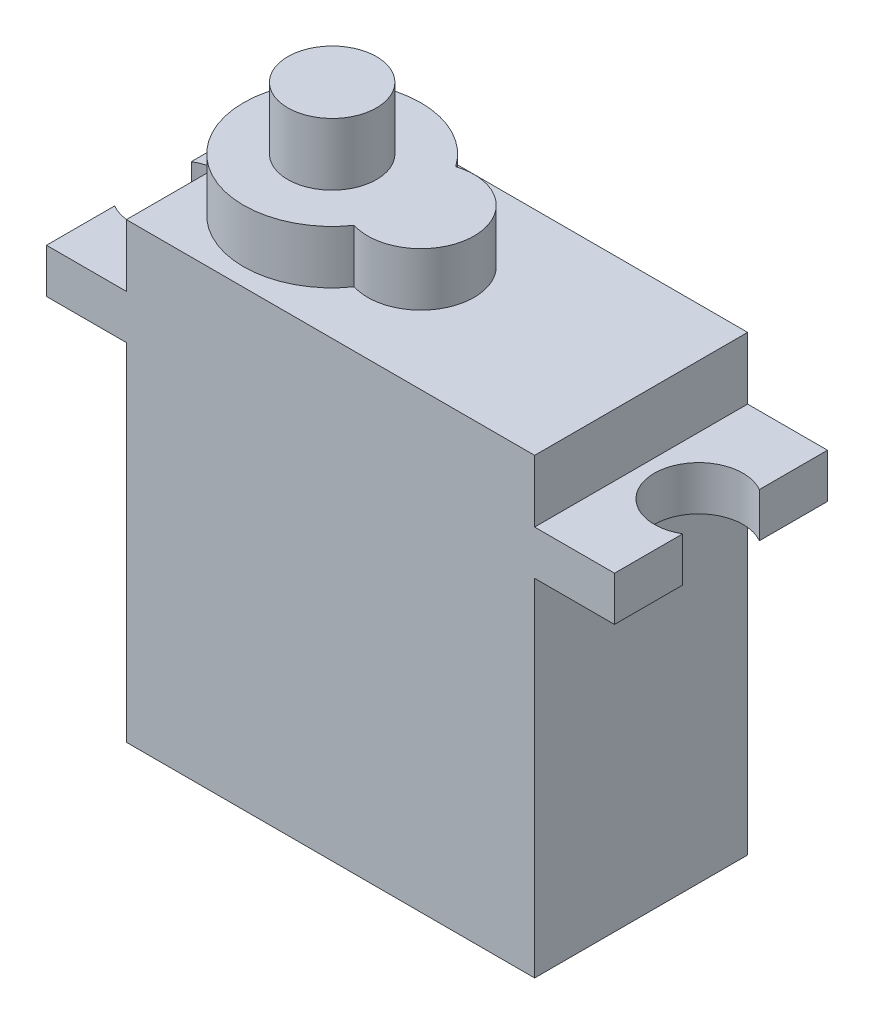
ISO-10303-21;
HEADER;
FILE_DESCRIPTION(('STEP AP214'),'2;1');
FILE_NAME('part.step','',(''),(''),'','','');
FILE_SCHEMA(('AUTOMOTIVE_DESIGN { 1 0 10303 214 1 1 1 1 }'));
ENDSEC;
DATA;
#1=APPLICATION_CONTEXT('core data for automotive mechanical design processes');
#2=APPLICATION_PROTOCOL_DEFINITION('international standard','automotive_design',2000,#1);
#3=PRODUCT_CONTEXT('',#1,'mechanical');
#4=PRODUCT('Part','Part','',(#3));
#5=PRODUCT_RELATED_PRODUCT_CATEGORY('part','',(#4));
#6=PRODUCT_DEFINITION_FORMATION('','',#4);
#7=PRODUCT_DEFINITION_CONTEXT('part definition',#1,'design');
#8=PRODUCT_DEFINITION('design','',#6,#7);
#9=PRODUCT_DEFINITION_SHAPE('','',#8);
#10=(LENGTH_UNIT() NAMED_UNIT(*) SI_UNIT(.MILLI.,.METRE.));
#11=(NAMED_UNIT(*) PLANE_ANGLE_UNIT() SI_UNIT($,.RADIAN.));
#12=(NAMED_UNIT(*) SI_UNIT($,.STERADIAN.) SOLID_ANGLE_UNIT());
#13=UNCERTAINTY_MEASURE_WITH_UNIT(LENGTH_MEASURE(1.E-05),#10,'distance_accuracy_value','');
#14=(GEOMETRIC_REPRESENTATION_CONTEXT(3) GLOBAL_UNCERTAINTY_ASSIGNED_CONTEXT((#13)) GLOBAL_UNIT_ASSIGNED_CONTEXT((#10,
#11,#12)) REPRESENTATION_CONTEXT('',''));
#15=CARTESIAN_POINT('',(0.,0.,0.));
#16=DIRECTION('',(0.,0.,1.));
#17=DIRECTION('',(1.,0.,0.));
#18=AXIS2_PLACEMENT_3D('',#15,#16,#17);
#19=CARTESIAN_POINT('',(16.,22.,6.));
#20=DIRECTION('',(-1.,0.,0.));
#21=DIRECTION('',(0.,0.,1.));
#22=AXIS2_PLACEMENT_3D('',#19,#20,#21);
#23=PLANE('',#22);
#24=DIRECTION('',(0.,0.,-1.));
#25=VECTOR('',#24,1.);
#26=CARTESIAN_POINT('',(16.,19.5,6.));
#27=LINE('',#26,#25);
#28=CARTESIAN_POINT('',(16.,19.5,6.));
#29=VERTEX_POINT('',#28);
#30=CARTESIAN_POINT('',(16.,19.5,2.16100835295899));
#31=VERTEX_POINT('',#30);
#32=EDGE_CURVE('E233',#29,#31,#27,.T.);
#33=ORIENTED_EDGE('',*,*,#32,.T.);
#34=DIRECTION('',(0.,1.,0.));
#35=VECTOR('',#34,1.);
#36=CARTESIAN_POINT('',(16.,0.,2.161008352959));
#37=LINE('',#36,#35);
#38=CARTESIAN_POINT('',(16.,22.,2.16100835295899));
#39=VERTEX_POINT('',#38);
#40=EDGE_CURVE('E11',#31,#39,#37,.T.);
#41=ORIENTED_EDGE('',*,*,#40,.T.);
#42=DIRECTION('',(0.,0.,-1.));
#43=VECTOR('',#42,1.);
#44=CARTESIAN_POINT('',(16.,22.,6.));
#45=LINE('',#44,#43);
#46=CARTESIAN_POINT('',(16.,22.,6.));
#47=VERTEX_POINT('',#46);
#48=EDGE_CURVE('E218',#47,#39,#45,.T.);
#49=ORIENTED_EDGE('',*,*,#48,.F.);
#50=DIRECTION('',(0.,-1.,0.));
#51=VECTOR('',#50,1.);
#52=CARTESIAN_POINT('',(16.,22.,6.));
#53=LINE('',#52,#51);
#54=EDGE_CURVE('E232',#47,#29,#53,.T.);
#55=ORIENTED_EDGE('',*,*,#54,.T.);
#56=EDGE_LOOP('',(#33,#41,#49,#55));
#57=FACE_BOUND('',#56,.T.);
#58=ADVANCED_FACE('F33',(#57),#23,.F.);
#59=CARTESIAN_POINT('',(-16.,22.,6.));
#60=DIRECTION('',(1.,0.,0.));
#61=DIRECTION('',(0.,0.,-1.));
#62=AXIS2_PLACEMENT_3D('',#59,#60,#61);
#63=PLANE('',#62);
#64=DIRECTION('',(0.,0.,1.));
#65=VECTOR('',#64,1.);
#66=CARTESIAN_POINT('',(-16.,19.5,6.));
#67=LINE('',#66,#65);
#68=CARTESIAN_POINT('',(-16.,19.5,-6.));
#69=VERTEX_POINT('',#68);
#70=CARTESIAN_POINT('',(-16.,19.5,-2.16100835295899));
#71=VERTEX_POINT('',#70);
#72=EDGE_CURVE('E241',#69,#71,#67,.T.);
#73=ORIENTED_EDGE('',*,*,#72,.T.);
#74=DIRECTION('',(0.,1.,0.));
#75=VECTOR('',#74,1.);
#76=CARTESIAN_POINT('',(-16.,0.,-2.16100835295899));
#77=LINE('',#76,#75);
#78=CARTESIAN_POINT('',(-16.,22.,-2.16100835295899));
#79=VERTEX_POINT('',#78);
#80=EDGE_CURVE('E174',#71,#79,#77,.T.);
#81=ORIENTED_EDGE('',*,*,#80,.T.);
#82=DIRECTION('',(0.,0.,1.));
#83=VECTOR('',#82,1.);
#84=CARTESIAN_POINT('',(-16.,22.,6.));
#85=LINE('',#84,#83);
#86=CARTESIAN_POINT('',(-16.,22.,-6.));
#87=VERTEX_POINT('',#86);
#88=EDGE_CURVE('E226',#87,#79,#85,.T.);
#89=ORIENTED_EDGE('',*,*,#88,.F.);
#90=DIRECTION('',(0.,-1.,0.));
#91=VECTOR('',#90,1.);
#92=CARTESIAN_POINT('',(-16.,22.,-6.));
#93=LINE('',#92,#91);
#94=EDGE_CURVE('E253',#87,#69,#93,.T.);
#95=ORIENTED_EDGE('',*,*,#94,.T.);
#96=EDGE_LOOP('',(#73,#81,#89,#95));
#97=FACE_BOUND('',#96,.T.);
#98=ADVANCED_FACE('F330',(#97),#63,.F.);
#99=CARTESIAN_POINT('',(0.,22.,0.));
#100=DIRECTION('',(0.,-1.,0.));
#101=DIRECTION('',(0.,0.,-1.));
#102=AXIS2_PLACEMENT_3D('',#99,#100,#101);
#103=PLANE('',#102);
#104=ORIENTED_EDGE('',*,*,#48,.T.);
#105=CARTESIAN_POINT('',(14.7430024270344,22.,0.));
#106=DIRECTION('',(0.,-1.,0.));
#107=DIRECTION('',(0.,0.,-1.));
#108=AXIS2_PLACEMENT_3D('',#105,#106,#107);
#109=CIRCLE('',#108,2.5);
#110=CARTESIAN_POINT('',(16.,22.,-2.16100835295899));
#111=VERTEX_POINT('',#110);
#112=EDGE_CURVE('E187',#39,#111,#109,.T.);
#113=ORIENTED_EDGE('',*,*,#112,.T.);
#114=CARTESIAN_POINT('',(16.,22.,-6.));
#115=VERTEX_POINT('',#114);
#116=EDGE_CURVE('E222',#111,#115,#45,.T.);
#117=ORIENTED_EDGE('',*,*,#116,.T.);
#118=DIRECTION('',(-1.,0.,0.));
#119=VECTOR('',#118,1.);
#120=CARTESIAN_POINT('',(-16.,22.,-6.));
#121=LINE('',#120,#119);
#122=CARTESIAN_POINT('',(11.5,22.,-6.));
#123=VERTEX_POINT('',#122);
#124=EDGE_CURVE('E223',#115,#123,#121,.T.);
#125=ORIENTED_EDGE('',*,*,#124,.T.);
#126=DIRECTION('',(0.,0.,-1.));
#127=VECTOR('',#126,1.);
#128=CARTESIAN_POINT('',(11.5,22.,6.));
#129=LINE('',#128,#127);
#130=CARTESIAN_POINT('',(11.5,22.,6.));
#131=VERTEX_POINT('',#130);
#132=EDGE_CURVE('E195',#131,#123,#129,.T.);
#133=ORIENTED_EDGE('',*,*,#132,.F.);
#134=DIRECTION('',(1.,0.,0.));
#135=VECTOR('',#134,1.);
#136=CARTESIAN_POINT('',(-16.,22.,6.));
#137=LINE('',#136,#135);
#138=EDGE_CURVE('E229',#131,#47,#137,.T.);
#139=ORIENTED_EDGE('',*,*,#138,.T.);
#140=EDGE_LOOP('',(#104,#113,#117,#125,#133,#139));
#141=FACE_BOUND('',#140,.T.);
#142=ADVANCED_FACE('F304',(#141),#103,.F.);
#143=ORIENTED_EDGE('',*,*,#88,.T.);
#144=CARTESIAN_POINT('',(-14.7430024270344,22.,0.));
#145=DIRECTION('',(0.,-1.,0.));
#146=DIRECTION('',(0.,0.,-1.));
#147=AXIS2_PLACEMENT_3D('',#144,#145,#146);
#148=CIRCLE('',#147,2.5);
#149=CARTESIAN_POINT('',(-16.,22.,2.16100835295899));
#150=VERTEX_POINT('',#149);
#151=EDGE_CURVE('E182',#79,#150,#148,.T.);
#152=ORIENTED_EDGE('',*,*,#151,.T.);
#153=CARTESIAN_POINT('',(-16.,22.,6.));
#154=VERTEX_POINT('',#153);
#155=EDGE_CURVE('E225',#150,#154,#85,.T.);
#156=ORIENTED_EDGE('',*,*,#155,.T.);
#157=CARTESIAN_POINT('',(-11.5,22.,6.));
#158=VERTEX_POINT('',#157);
#159=EDGE_CURVE('E230',#154,#158,#137,.T.);
#160=ORIENTED_EDGE('',*,*,#159,.T.);
#161=DIRECTION('',(0.,0.,1.));
#162=VECTOR('',#161,1.);
#163=CARTESIAN_POINT('',(-11.5,22.,-6.));
#164=LINE('',#163,#162);
#165=CARTESIAN_POINT('',(-11.5,22.,-6.));
#166=VERTEX_POINT('',#165);
#167=EDGE_CURVE('E190',#166,#158,#164,.T.);
#168=ORIENTED_EDGE('',*,*,#167,.F.);
#169=EDGE_CURVE('E221',#166,#87,#121,.T.);
#170=ORIENTED_EDGE('',*,*,#169,.T.);
#171=EDGE_LOOP('',(#143,#152,#156,#160,#168,#170));
#172=FACE_BOUND('',#171,.T.);
#173=ADVANCED_FACE('F378',(#172),#103,.F.);
#174=CARTESIAN_POINT('',(11.5,19.5,6.));
#175=DIRECTION('',(-1.,0.,0.));
#176=DIRECTION('',(0.,0.,1.));
#177=AXIS2_PLACEMENT_3D('',#174,#175,#176);
#178=PLANE('',#177);
#179=DIRECTION('',(0.,0.,-1.));
#180=VECTOR('',#179,1.);
#181=CARTESIAN_POINT('',(11.5,0.,6.));
#182=LINE('',#181,#180);
#183=CARTESIAN_POINT('',(11.5,0.,6.));
#184=VERTEX_POINT('',#183);
#185=CARTESIAN_POINT('',(11.5,0.,-6.));
#186=VERTEX_POINT('',#185);
#187=EDGE_CURVE('E259',#184,#186,#182,.T.);
#188=ORIENTED_EDGE('',*,*,#187,.T.);
#189=DIRECTION('',(0.,-1.,0.));
#190=VECTOR('',#189,1.);
#191=CARTESIAN_POINT('',(11.5,19.5,-6.));
#192=LINE('',#191,#190);
#193=CARTESIAN_POINT('',(11.5,19.5,-6.));
#194=VERTEX_POINT('',#193);
#195=EDGE_CURVE('E283',#194,#186,#192,.T.);
#196=ORIENTED_EDGE('',*,*,#195,.F.);
#197=DIRECTION('',(0.,0.,-1.));
#198=VECTOR('',#197,1.);
#199=CARTESIAN_POINT('',(11.5,19.5,6.));
#200=LINE('',#199,#198);
#201=CARTESIAN_POINT('',(11.5,19.5,6.));
#202=VERTEX_POINT('',#201);
#203=EDGE_CURVE('E260',#202,#194,#200,.T.);
#204=ORIENTED_EDGE('',*,*,#203,.F.);
#205=DIRECTION('',(0.,-1.,0.));
#206=VECTOR('',#205,1.);
#207=CARTESIAN_POINT('',(11.5,19.5,6.));
#208=LINE('',#207,#206);
#209=EDGE_CURVE('E267',#202,#184,#208,.T.);
#210=ORIENTED_EDGE('',*,*,#209,.T.);
#211=EDGE_LOOP('',(#188,#196,#204,#210));
#212=FACE_BOUND('',#211,.T.);
#213=ADVANCED_FACE('F35',(#212),#178,.F.);
#214=CARTESIAN_POINT('',(-11.5,19.5,-6.));
#215=DIRECTION('',(0.,0.,1.));
#216=DIRECTION('',(1.,0.,0.));
#217=AXIS2_PLACEMENT_3D('',#214,#215,#216);
#218=PLANE('',#217);
#219=DIRECTION('',(-1.,0.,0.));
#220=VECTOR('',#219,1.);
#221=CARTESIAN_POINT('',(-11.5,0.,-6.));
#222=LINE('',#221,#220);
#223=CARTESIAN_POINT('',(-11.5,0.,-6.));
#224=VERTEX_POINT('',#223);
#225=EDGE_CURVE('E270',#186,#224,#222,.T.);
#226=ORIENTED_EDGE('',*,*,#225,.T.);
#227=DIRECTION('',(0.,-1.,0.));
#228=VECTOR('',#227,1.);
#229=CARTESIAN_POINT('',(-11.5,19.5,-6.));
#230=LINE('',#229,#228);
#231=CARTESIAN_POINT('',(-11.5,19.5,-6.));
#232=VERTEX_POINT('',#231);
#233=EDGE_CURVE('E280',#232,#224,#230,.T.);
#234=ORIENTED_EDGE('',*,*,#233,.F.);
#235=DIRECTION('',(-1.,0.,0.));
#236=VECTOR('',#235,1.);
#237=CARTESIAN_POINT('',(-16.,19.5,-6.));
#238=LINE('',#237,#236);
#239=EDGE_CURVE('E236',#232,#69,#238,.T.);
#240=ORIENTED_EDGE('',*,*,#239,.T.);
#241=ORIENTED_EDGE('',*,*,#94,.F.);
#242=ORIENTED_EDGE('',*,*,#169,.F.);
#243=DIRECTION('',(0.,-1.,0.));
#244=VECTOR('',#243,1.);
#245=CARTESIAN_POINT('',(-11.5,25.5,-6.));
#246=LINE('',#245,#244);
#247=CARTESIAN_POINT('',(-11.5,25.5,-6.));
#248=VERTEX_POINT('',#247);
#249=EDGE_CURVE('E214',#248,#166,#246,.T.);
#250=ORIENTED_EDGE('',*,*,#249,.F.);
#251=DIRECTION('',(-1.,0.,0.));
#252=VECTOR('',#251,1.);
#253=CARTESIAN_POINT('',(11.5,25.5,-6.));
#254=LINE('',#253,#252);
#255=CARTESIAN_POINT('',(11.5,25.5,-6.));
#256=VERTEX_POINT('',#255);
#257=EDGE_CURVE('E191',#256,#248,#254,.T.);
#258=ORIENTED_EDGE('',*,*,#257,.F.);
#259=DIRECTION('',(0.,-1.,0.));
#260=VECTOR('',#259,1.);
#261=CARTESIAN_POINT('',(11.5,25.5,-6.));
#262=LINE('',#261,#260);
#263=EDGE_CURVE('E201',#256,#123,#262,.T.);
#264=ORIENTED_EDGE('',*,*,#263,.T.);
#265=ORIENTED_EDGE('',*,*,#124,.F.);
#266=DIRECTION('',(0.,-1.,0.));
#267=VECTOR('',#266,1.);
#268=CARTESIAN_POINT('',(16.,22.,-6.));
#269=LINE('',#268,#267);
#270=CARTESIAN_POINT('',(16.,19.5,-6.));
#271=VERTEX_POINT('',#270);
#272=EDGE_CURVE('E256',#115,#271,#269,.T.);
#273=ORIENTED_EDGE('',*,*,#272,.T.);
#274=EDGE_CURVE('E237',#271,#194,#238,.T.);
#275=ORIENTED_EDGE('',*,*,#274,.T.);
#276=ORIENTED_EDGE('',*,*,#195,.T.);
#277=EDGE_LOOP('',(#226,#234,#240,#241,#242,#250,#258,#264,#265,#273,#275,#276));
#278=FACE_BOUND('',#277,.T.);
#279=ADVANCED_FACE('F300',(#278),#218,.F.);
#280=CARTESIAN_POINT('',(-11.5,19.5,6.));
#281=DIRECTION('',(1.,0.,0.));
#282=DIRECTION('',(0.,0.,-1.));
#283=AXIS2_PLACEMENT_3D('',#280,#281,#282);
#284=PLANE('',#283);
#285=DIRECTION('',(0.,0.,1.));
#286=VECTOR('',#285,1.);
#287=CARTESIAN_POINT('',(-11.5,0.,6.));
#288=LINE('',#287,#286);
#289=CARTESIAN_POINT('',(-11.5,0.,6.));
#290=VERTEX_POINT('',#289);
#291=EDGE_CURVE('E272',#224,#290,#288,.T.);
#292=ORIENTED_EDGE('',*,*,#291,.T.);
#293=DIRECTION('',(0.,-1.,0.));
#294=VECTOR('',#293,1.);
#295=CARTESIAN_POINT('',(-11.5,19.5,6.));
#296=LINE('',#295,#294);
#297=CARTESIAN_POINT('',(-11.5,19.5,6.));
#298=VERTEX_POINT('',#297);
#299=EDGE_CURVE('E277',#298,#290,#296,.T.);
#300=ORIENTED_EDGE('',*,*,#299,.F.);
#301=DIRECTION('',(0.,0.,1.));
#302=VECTOR('',#301,1.);
#303=CARTESIAN_POINT('',(-11.5,19.5,6.));
#304=LINE('',#303,#302);
#305=EDGE_CURVE('E263',#232,#298,#304,.T.);
#306=ORIENTED_EDGE('',*,*,#305,.F.);
#307=ORIENTED_EDGE('',*,*,#233,.T.);
#308=EDGE_LOOP('',(#292,#300,#306,#307));
#309=FACE_BOUND('',#308,.T.);
#310=ADVANCED_FACE('F397',(#309),#284,.F.);
#311=CARTESIAN_POINT('',(-11.5,19.5,6.));
#312=DIRECTION('',(0.,0.,-1.));
#313=DIRECTION('',(-1.,0.,0.));
#314=AXIS2_PLACEMENT_3D('',#311,#312,#313);
#315=PLANE('',#314);
#316=DIRECTION('',(1.,0.,0.));
#317=VECTOR('',#316,1.);
#318=CARTESIAN_POINT('',(-11.5,0.,6.));
#319=LINE('',#318,#317);
#320=EDGE_CURVE('E264',#290,#184,#319,.T.);
#321=ORIENTED_EDGE('',*,*,#320,.T.);
#322=ORIENTED_EDGE('',*,*,#209,.F.);
#323=DIRECTION('',(1.,0.,0.));
#324=VECTOR('',#323,1.);
#325=CARTESIAN_POINT('',(-16.,19.5,6.));
#326=LINE('',#325,#324);
#327=EDGE_CURVE('E244',#202,#29,#326,.T.);
#328=ORIENTED_EDGE('',*,*,#327,.T.);
#329=ORIENTED_EDGE('',*,*,#54,.F.);
#330=ORIENTED_EDGE('',*,*,#138,.F.);
#331=DIRECTION('',(0.,-1.,0.));
#332=VECTOR('',#331,1.);
#333=CARTESIAN_POINT('',(11.5,25.5,6.));
#334=LINE('',#333,#332);
#335=CARTESIAN_POINT('',(11.5,25.5,6.));
#336=VERTEX_POINT('',#335);
#337=EDGE_CURVE('E208',#336,#131,#334,.T.);
#338=ORIENTED_EDGE('',*,*,#337,.F.);
#339=DIRECTION('',(1.,0.,0.));
#340=VECTOR('',#339,1.);
#341=CARTESIAN_POINT('',(-11.5,25.5,6.));
#342=LINE('',#341,#340);
#343=CARTESIAN_POINT('',(-11.5,25.5,6.));
#344=VERTEX_POINT('',#343);
#345=EDGE_CURVE('E197',#344,#336,#342,.T.);
#346=ORIENTED_EDGE('',*,*,#345,.F.);
#347=DIRECTION('',(0.,-1.,0.));
#348=VECTOR('',#347,1.);
#349=CARTESIAN_POINT('',(-11.5,25.5,6.));
#350=LINE('',#349,#348);
#351=EDGE_CURVE('E211',#344,#158,#350,.T.);
#352=ORIENTED_EDGE('',*,*,#351,.T.);
#353=ORIENTED_EDGE('',*,*,#159,.F.);
#354=DIRECTION('',(0.,-1.,0.));
#355=VECTOR('',#354,1.);
#356=CARTESIAN_POINT('',(-16.,22.,6.));
#357=LINE('',#356,#355);
#358=CARTESIAN_POINT('',(-16.,19.5,6.));
#359=VERTEX_POINT('',#358);
#360=EDGE_CURVE('E250',#154,#359,#357,.T.);
#361=ORIENTED_EDGE('',*,*,#360,.T.);
#362=EDGE_CURVE('E245',#359,#298,#326,.T.);
#363=ORIENTED_EDGE('',*,*,#362,.T.);
#364=ORIENTED_EDGE('',*,*,#299,.T.);
#365=EDGE_LOOP('',(#321,#322,#328,#329,#330,#338,#346,#352,#353,#361,#363,#364));
#366=FACE_BOUND('',#365,.T.);
#367=ADVANCED_FACE('F312',(#366),#315,.F.);
#368=CARTESIAN_POINT('',(0.,0.,0.));
#369=DIRECTION('',(0.,-1.,0.));
#370=DIRECTION('',(0.,0.,-1.));
#371=AXIS2_PLACEMENT_3D('',#368,#369,#370);
#372=PLANE('',#371);
#373=ORIENTED_EDGE('',*,*,#187,.F.);
#374=ORIENTED_EDGE('',*,*,#320,.F.);
#375=ORIENTED_EDGE('',*,*,#291,.F.);
#376=ORIENTED_EDGE('',*,*,#225,.F.);
#377=EDGE_LOOP('',(#373,#374,#375,#376));
#378=FACE_BOUND('',#377,.T.);
#379=ADVANCED_FACE('F346',(#378),#372,.T.);
#380=CARTESIAN_POINT('',(0.,19.5,0.));
#381=DIRECTION('',(0.,-1.,0.));
#382=DIRECTION('',(0.,0.,-1.));
#383=AXIS2_PLACEMENT_3D('',#380,#381,#382);
#384=PLANE('',#383);
#385=CARTESIAN_POINT('',(14.7430024270344,19.5,0.));
#386=DIRECTION('',(0.,-1.,0.));
#387=DIRECTION('',(0.,0.,-1.));
#388=AXIS2_PLACEMENT_3D('',#385,#386,#387);
#389=CIRCLE('',#388,2.5);
#390=CARTESIAN_POINT('',(16.,19.5,-2.161008352959));
#391=VERTEX_POINT('',#390);
#392=EDGE_CURVE('E55',#31,#391,#389,.T.);
#393=ORIENTED_EDGE('',*,*,#392,.F.);
#394=ORIENTED_EDGE('',*,*,#32,.F.);
#395=ORIENTED_EDGE('',*,*,#327,.F.);
#396=ORIENTED_EDGE('',*,*,#203,.T.);
#397=ORIENTED_EDGE('',*,*,#274,.F.);
#398=EDGE_CURVE('E217',#391,#271,#27,.T.);
#399=ORIENTED_EDGE('',*,*,#398,.F.);
#400=EDGE_LOOP('',(#393,#394,#395,#396,#397,#399));
#401=FACE_BOUND('',#400,.T.);
#402=ADVANCED_FACE('F294',(#401),#384,.T.);
#403=ORIENTED_EDGE('',*,*,#116,.F.);
#404=DIRECTION('',(0.,1.,0.));
#405=VECTOR('',#404,1.);
#406=CARTESIAN_POINT('',(16.,0.,-2.161008352959));
#407=LINE('',#406,#405);
#408=EDGE_CURVE('E41',#111,#391,#407,.F.);
#409=ORIENTED_EDGE('',*,*,#408,.T.);
#410=ORIENTED_EDGE('',*,*,#398,.T.);
#411=ORIENTED_EDGE('',*,*,#272,.F.);
#412=EDGE_LOOP('',(#403,#409,#410,#411));
#413=FACE_BOUND('',#412,.T.);
#414=ADVANCED_FACE('F290',(#413),#23,.F.);
#415=ORIENTED_EDGE('',*,*,#155,.F.);
#416=DIRECTION('',(0.,1.,0.));
#417=VECTOR('',#416,1.);
#418=CARTESIAN_POINT('',(-16.,0.,2.16100835295899));
#419=LINE('',#418,#417);
#420=CARTESIAN_POINT('',(-16.,19.5,2.16100835295899));
#421=VERTEX_POINT('',#420);
#422=EDGE_CURVE('E177',#421,#150,#419,.T.);
#423=ORIENTED_EDGE('',*,*,#422,.F.);
#424=EDGE_CURVE('E240',#421,#359,#67,.T.);
#425=ORIENTED_EDGE('',*,*,#424,.T.);
#426=ORIENTED_EDGE('',*,*,#360,.F.);
#427=EDGE_LOOP('',(#415,#423,#425,#426));
#428=FACE_BOUND('',#427,.T.);
#429=ADVANCED_FACE('F337',(#428),#63,.F.);
#430=CARTESIAN_POINT('',(-14.7430024270344,19.5,0.));
#431=DIRECTION('',(0.,-1.,0.));
#432=DIRECTION('',(0.,0.,-1.));
#433=AXIS2_PLACEMENT_3D('',#430,#431,#432);
#434=CIRCLE('',#433,2.5);
#435=EDGE_CURVE('E286',#71,#421,#434,.T.);
#436=ORIENTED_EDGE('',*,*,#435,.F.);
#437=ORIENTED_EDGE('',*,*,#72,.F.);
#438=ORIENTED_EDGE('',*,*,#239,.F.);
#439=ORIENTED_EDGE('',*,*,#305,.T.);
#440=ORIENTED_EDGE('',*,*,#362,.F.);
#441=ORIENTED_EDGE('',*,*,#424,.F.);
#442=EDGE_LOOP('',(#436,#437,#438,#439,#440,#441));
#443=FACE_BOUND('',#442,.T.);
#444=ADVANCED_FACE('F344',(#443),#384,.T.);
#445=CARTESIAN_POINT('',(-11.5,25.5,-6.));
#446=DIRECTION('',(1.,0.,0.));
#447=DIRECTION('',(0.,0.,-1.));
#448=AXIS2_PLACEMENT_3D('',#445,#446,#447);
#449=PLANE('',#448);
#450=ORIENTED_EDGE('',*,*,#167,.T.);
#451=ORIENTED_EDGE('',*,*,#351,.F.);
#452=DIRECTION('',(0.,0.,1.));
#453=VECTOR('',#452,1.);
#454=CARTESIAN_POINT('',(-11.5,25.5,-6.));
#455=LINE('',#454,#453);
#456=EDGE_CURVE('E194',#248,#344,#455,.T.);
#457=ORIENTED_EDGE('',*,*,#456,.F.);
#458=ORIENTED_EDGE('',*,*,#249,.T.);
#459=EDGE_LOOP('',(#450,#451,#457,#458));
#460=FACE_BOUND('',#459,.T.);
#461=ADVANCED_FACE('F354',(#460),#449,.F.);
#462=CARTESIAN_POINT('',(11.5,25.5,6.));
#463=DIRECTION('',(-1.,0.,0.));
#464=DIRECTION('',(0.,0.,1.));
#465=AXIS2_PLACEMENT_3D('',#462,#463,#464);
#466=PLANE('',#465);
#467=ORIENTED_EDGE('',*,*,#132,.T.);
#468=ORIENTED_EDGE('',*,*,#263,.F.);
#469=DIRECTION('',(0.,0.,-1.));
#470=VECTOR('',#469,1.);
#471=CARTESIAN_POINT('',(11.5,25.5,6.));
#472=LINE('',#471,#470);
#473=EDGE_CURVE('E199',#336,#256,#472,.T.);
#474=ORIENTED_EDGE('',*,*,#473,.F.);
#475=ORIENTED_EDGE('',*,*,#337,.T.);
#476=EDGE_LOOP('',(#467,#468,#474,#475));
#477=FACE_BOUND('',#476,.T.);
#478=ADVANCED_FACE('F307',(#477),#466,.F.);
#479=CARTESIAN_POINT('',(0.,25.5,0.));
#480=DIRECTION('',(0.,1.,0.));
#481=DIRECTION('',(0.,0.,1.));
#482=AXIS2_PLACEMENT_3D('',#479,#480,#481);
#483=PLANE('',#482);
#484=CARTESIAN_POINT('',(-0.90587775781016,25.5,0.));
#485=DIRECTION('',(0.,1.,0.));
#486=DIRECTION('',(0.,0.,1.));
#487=AXIS2_PLACEMENT_3D('',#484,#485,#486);
#488=CIRCLE('',#487,3.);
#489=CARTESIAN_POINT('',(-1.80587775781016,25.5,2.86181760425084));
#490=VERTEX_POINT('',#489);
#491=CARTESIAN_POINT('',(-1.80587775781016,25.5,-2.86181760425084));
#492=VERTEX_POINT('',#491);
#493=EDGE_CURVE('E173',#490,#492,#488,.T.);
#494=ORIENTED_EDGE('',*,*,#493,.F.);
#495=CARTESIAN_POINT('',(-5.90587775781016,25.5,0.));
#496=DIRECTION('',(0.,1.,0.));
#497=DIRECTION('',(0.,0.,1.));
#498=AXIS2_PLACEMENT_3D('',#495,#496,#497);
#499=CIRCLE('',#498,5.);
#500=EDGE_CURVE('E47',#492,#490,#499,.T.);
#501=ORIENTED_EDGE('',*,*,#500,.F.);
#502=EDGE_LOOP('',(#494,#501));
#503=FACE_BOUND('',#502,.T.);
#504=ORIENTED_EDGE('',*,*,#257,.T.);
#505=ORIENTED_EDGE('',*,*,#456,.T.);
#506=ORIENTED_EDGE('',*,*,#345,.T.);
#507=ORIENTED_EDGE('',*,*,#473,.T.);
#508=EDGE_LOOP('',(#504,#505,#506,#507));
#509=FACE_BOUND('',#508,.T.);
#510=ADVANCED_FACE('F325',(#503,#509),#483,.T.);
#511=CARTESIAN_POINT('',(-14.7430024270344,0.,0.));
#512=DIRECTION('',(0.,1.,0.));
#513=DIRECTION('',(0.,0.,1.));
#514=AXIS2_PLACEMENT_3D('',#511,#512,#513);
#515=CYLINDRICAL_SURFACE('',#514,2.5);
#516=ORIENTED_EDGE('',*,*,#80,.F.);
#517=ORIENTED_EDGE('',*,*,#435,.T.);
#518=ORIENTED_EDGE('',*,*,#422,.T.);
#519=ORIENTED_EDGE('',*,*,#151,.F.);
#520=EDGE_LOOP('',(#516,#517,#518,#519));
#521=FACE_BOUND('',#520,.T.);
#522=ADVANCED_FACE('F318',(#521),#515,.F.);
#523=CARTESIAN_POINT('',(14.7430024270344,0.,0.));
#524=DIRECTION('',(0.,1.,0.));
#525=DIRECTION('',(0.,0.,1.));
#526=AXIS2_PLACEMENT_3D('',#523,#524,#525);
#527=CYLINDRICAL_SURFACE('',#526,2.5);
#528=ORIENTED_EDGE('',*,*,#40,.F.);
#529=ORIENTED_EDGE('',*,*,#392,.T.);
#530=ORIENTED_EDGE('',*,*,#408,.F.);
#531=ORIENTED_EDGE('',*,*,#112,.F.);
#532=EDGE_LOOP('',(#528,#529,#530,#531));
#533=FACE_BOUND('',#532,.T.);
#534=ADVANCED_FACE('F316',(#533),#527,.F.);
#535=CARTESIAN_POINT('',(-0.90587775781016,28.5,0.));
#536=DIRECTION('',(0.,-1.,0.));
#537=DIRECTION('',(0.,0.,-1.));
#538=AXIS2_PLACEMENT_3D('',#535,#536,#537);
#539=CYLINDRICAL_SURFACE('',#538,3.);
#540=ORIENTED_EDGE('',*,*,#493,.T.);
#541=DIRECTION('',(0.,-1.,0.));
#542=VECTOR('',#541,1.);
#543=CARTESIAN_POINT('',(-1.80587775781016,28.5,-2.86181760425084));
#544=LINE('',#543,#542);
#545=CARTESIAN_POINT('',(-1.80587775781016,28.5,-2.86181760425084));
#546=VERTEX_POINT('',#545);
#547=EDGE_CURVE('E161',#546,#492,#544,.T.);
#548=ORIENTED_EDGE('',*,*,#547,.F.);
#549=CARTESIAN_POINT('',(-0.90587775781016,28.5,0.));
#550=DIRECTION('',(0.,1.,0.));
#551=DIRECTION('',(0.,0.,1.));
#552=AXIS2_PLACEMENT_3D('',#549,#550,#551);
#553=CIRCLE('',#552,3.);
#554=CARTESIAN_POINT('',(-1.80587775781016,28.5,2.86181760425084));
#555=VERTEX_POINT('',#554);
#556=EDGE_CURVE('E167',#555,#546,#553,.T.);
#557=ORIENTED_EDGE('',*,*,#556,.F.);
#558=DIRECTION('',(0.,-1.,0.));
#559=VECTOR('',#558,1.);
#560=CARTESIAN_POINT('',(-1.80587775781016,28.5,2.86181760425084));
#561=LINE('',#560,#559);
#562=EDGE_CURVE('E164',#555,#490,#561,.T.);
#563=ORIENTED_EDGE('',*,*,#562,.T.);
#564=EDGE_LOOP('',(#540,#548,#557,#563));
#565=FACE_BOUND('',#564,.T.);
#566=ADVANCED_FACE('F172',(#565),#539,.T.);
#567=CARTESIAN_POINT('',(-5.90587775781016,28.5,0.));
#568=DIRECTION('',(0.,-1.,0.));
#569=DIRECTION('',(0.,0.,-1.));
#570=AXIS2_PLACEMENT_3D('',#567,#568,#569);
#571=CYLINDRICAL_SURFACE('',#570,5.);
#572=ORIENTED_EDGE('',*,*,#500,.T.);
#573=ORIENTED_EDGE('',*,*,#562,.F.);
#574=CARTESIAN_POINT('',(-5.90587775781016,28.5,0.));
#575=DIRECTION('',(0.,1.,0.));
#576=DIRECTION('',(0.,0.,1.));
#577=AXIS2_PLACEMENT_3D('',#574,#575,#576);
#578=CIRCLE('',#577,5.);
#579=EDGE_CURVE('E157',#546,#555,#578,.T.);
#580=ORIENTED_EDGE('',*,*,#579,.F.);
#581=ORIENTED_EDGE('',*,*,#547,.T.);
#582=EDGE_LOOP('',(#572,#573,#580,#581));
#583=FACE_BOUND('',#582,.T.);
#584=ADVANCED_FACE('F159',(#583),#571,.T.);
#585=CARTESIAN_POINT('',(-3.40587775781016,28.5,0.));
#586=DIRECTION('',(0.,1.,0.));
#587=DIRECTION('',(0.,0.,1.));
#588=AXIS2_PLACEMENT_3D('',#585,#586,#587);
#589=PLANE('',#588);
#590=CARTESIAN_POINT('',(-5.90587775781016,28.5,0.));
#591=DIRECTION('',(0.,1.,0.));
#592=DIRECTION('',(0.,0.,1.));
#593=AXIS2_PLACEMENT_3D('',#590,#591,#592);
#594=CIRCLE('',#593,2.5);
#595=CARTESIAN_POINT('',(-5.90587775781016,28.5,2.5));
#596=VERTEX_POINT('',#595);
#597=EDGE_CURVE('E523',#596,#596,#594,.T.);
#598=ORIENTED_EDGE('',*,*,#597,.F.);
#599=EDGE_LOOP('',(#598));
#600=FACE_BOUND('',#599,.T.);
#601=ORIENTED_EDGE('',*,*,#556,.T.);
#602=ORIENTED_EDGE('',*,*,#579,.T.);
#603=EDGE_LOOP('',(#601,#602));
#604=FACE_BOUND('',#603,.T.);
#605=ADVANCED_FACE('F169',(#600,#604),#589,.T.);
#606=CARTESIAN_POINT('',(-5.90587775781016,32.,0.));
#607=DIRECTION('',(0.,-1.,0.));
#608=DIRECTION('',(0.,0.,-1.));
#609=AXIS2_PLACEMENT_3D('',#606,#607,#608);
#610=CYLINDRICAL_SURFACE('',#609,2.5);
#611=CARTESIAN_POINT('',(-5.90587775781016,32.,0.));
#612=DIRECTION('',(0.,1.,0.));
#613=DIRECTION('',(0.,0.,1.));
#614=AXIS2_PLACEMENT_3D('',#611,#612,#613);
#615=CIRCLE('',#614,2.5);
#616=CARTESIAN_POINT('',(-5.90587775781016,32.,2.5));
#617=VERTEX_POINT('',#616);
#618=EDGE_CURVE('E522',#617,#617,#615,.T.);
#619=ORIENTED_EDGE('',*,*,#618,.F.);
#620=EDGE_LOOP('',(#619));
#621=FACE_BOUND('',#620,.T.);
#622=ORIENTED_EDGE('',*,*,#597,.T.);
#623=EDGE_LOOP('',(#622));
#624=FACE_BOUND('',#623,.T.);
#625=ADVANCED_FACE('F495',(#621,#624),#610,.T.);
#626=CARTESIAN_POINT('',(-5.90587775781016,32.,0.));
#627=DIRECTION('',(0.,1.,0.));
#628=DIRECTION('',(0.,0.,1.));
#629=AXIS2_PLACEMENT_3D('',#626,#627,#628);
#630=PLANE('',#629);
#631=ORIENTED_EDGE('',*,*,#618,.T.);
#632=EDGE_LOOP('',(#631));
#633=FACE_BOUND('',#632,.T.);
#634=ADVANCED_FACE('F504',(#633),#630,.T.);
#635=CLOSED_SHELL('',(#58,#98,#142,#173,#213,#279,#310,#367,#379,#402,#414,#429,#444,#461,#478,
#510,#522,#534,#566,#584,#605,#625,#634));
#636=MANIFOLD_SOLID_BREP('B2',#635);
#637=ADVANCED_BREP_SHAPE_REPRESENTATION('',(#18,#636),#14);
#638=SHAPE_DEFINITION_REPRESENTATION(#9,#637);
ENDSEC;
END-ISO-10303-21;
